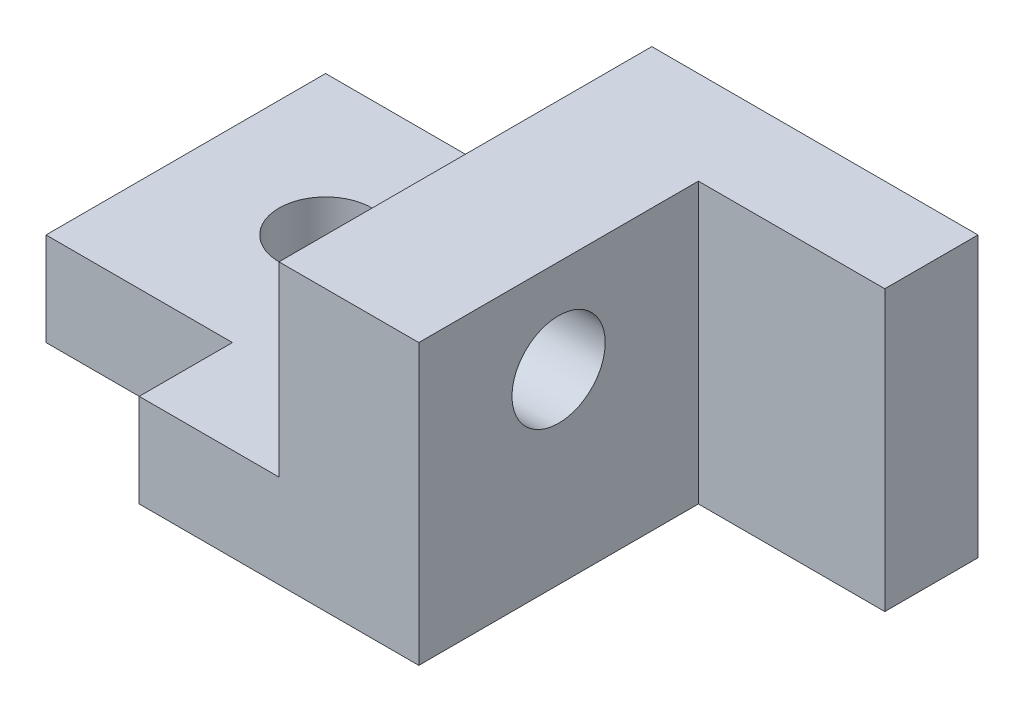
ISO-10303-21;
HEADER;
FILE_DESCRIPTION(('STEP AP214'),'2;1');
FILE_NAME('part.step','',(''),(''),'','','');
FILE_SCHEMA(('AUTOMOTIVE_DESIGN { 1 0 10303 214 1 1 1 1 }'));
ENDSEC;
DATA;
#1=APPLICATION_CONTEXT('core data for automotive mechanical design processes');
#2=APPLICATION_PROTOCOL_DEFINITION('international standard','automotive_design',2000,#1);
#3=PRODUCT_CONTEXT('',#1,'mechanical');
#4=PRODUCT('Part','Part','',(#3));
#5=PRODUCT_RELATED_PRODUCT_CATEGORY('part','',(#4));
#6=PRODUCT_DEFINITION_FORMATION('','',#4);
#7=PRODUCT_DEFINITION_CONTEXT('part definition',#1,'design');
#8=PRODUCT_DEFINITION('design','',#6,#7);
#9=PRODUCT_DEFINITION_SHAPE('','',#8);
#10=(LENGTH_UNIT() NAMED_UNIT(*) SI_UNIT(.MILLI.,.METRE.));
#11=(NAMED_UNIT(*) PLANE_ANGLE_UNIT() SI_UNIT($,.RADIAN.));
#12=(NAMED_UNIT(*) SI_UNIT($,.STERADIAN.) SOLID_ANGLE_UNIT());
#13=UNCERTAINTY_MEASURE_WITH_UNIT(LENGTH_MEASURE(1.E-05),#10,'distance_accuracy_value','');
#14=(GEOMETRIC_REPRESENTATION_CONTEXT(3) GLOBAL_UNCERTAINTY_ASSIGNED_CONTEXT((#13)) GLOBAL_UNIT_ASSIGNED_CONTEXT((#10,
#11,#12)) REPRESENTATION_CONTEXT('',''));
#15=CARTESIAN_POINT('',(0.,0.,0.));
#16=DIRECTION('',(0.,0.,1.));
#17=DIRECTION('',(1.,0.,0.));
#18=AXIS2_PLACEMENT_3D('',#15,#16,#17);
#19=CARTESIAN_POINT('',(0.,30.,0.));
#20=DIRECTION('',(1.,0.,0.));
#21=DIRECTION('',(0.,0.,-1.));
#22=AXIS2_PLACEMENT_3D('',#19,#20,#21);
#23=PLANE('',#22);
#24=DIRECTION('',(0.,0.,1.));
#25=VECTOR('',#24,1.);
#26=CARTESIAN_POINT('',(0.,0.,0.));
#27=LINE('',#26,#25);
#28=CARTESIAN_POINT('',(0.,0.,-40.));
#29=VERTEX_POINT('',#28);
#30=CARTESIAN_POINT('',(0.,0.,-10.));
#31=VERTEX_POINT('',#30);
#32=EDGE_CURVE('E143',#29,#31,#27,.T.);
#33=ORIENTED_EDGE('',*,*,#32,.T.);
#34=DIRECTION('',(0.,1.,0.));
#35=VECTOR('',#34,1.);
#36=CARTESIAN_POINT('',(0.,0.,-10.));
#37=LINE('',#36,#35);
#38=CARTESIAN_POINT('',(0.,10.,-10.));
#39=VERTEX_POINT('',#38);
#40=EDGE_CURVE('E218',#31,#39,#37,.T.);
#41=ORIENTED_EDGE('',*,*,#40,.T.);
#42=DIRECTION('',(0.,0.,1.));
#43=VECTOR('',#42,1.);
#44=CARTESIAN_POINT('',(0.,10.,-40.));
#45=LINE('',#44,#43);
#46=CARTESIAN_POINT('',(0.,10.,-40.));
#47=VERTEX_POINT('',#46);
#48=EDGE_CURVE('E195',#47,#39,#45,.T.);
#49=ORIENTED_EDGE('',*,*,#48,.F.);
#50=DIRECTION('',(0.,-1.,0.));
#51=VECTOR('',#50,1.);
#52=CARTESIAN_POINT('',(0.,30.,-40.));
#53=LINE('',#52,#51);
#54=EDGE_CURVE('E48',#47,#29,#53,.T.);
#55=ORIENTED_EDGE('',*,*,#54,.T.);
#56=EDGE_LOOP('',(#33,#41,#49,#55));
#57=FACE_BOUND('',#56,.T.);
#58=ADVANCED_FACE('F39',(#57),#23,.F.);
#59=CARTESIAN_POINT('',(0.,30.,0.));
#60=DIRECTION('',(0.,0.,-1.));
#61=DIRECTION('',(-1.,0.,0.));
#62=AXIS2_PLACEMENT_3D('',#59,#60,#61);
#63=PLANE('',#62);
#64=DIRECTION('',(-1.,0.,0.));
#65=VECTOR('',#64,1.);
#66=CARTESIAN_POINT('',(35.,10.,0.));
#67=LINE('',#66,#65);
#68=CARTESIAN_POINT('',(35.,10.,0.));
#69=VERTEX_POINT('',#68);
#70=CARTESIAN_POINT('',(20.,10.,0.));
#71=VERTEX_POINT('',#70);
#72=EDGE_CURVE('E134',#69,#71,#67,.T.);
#73=ORIENTED_EDGE('',*,*,#72,.T.);
#74=DIRECTION('',(0.,1.,0.));
#75=VECTOR('',#74,1.);
#76=CARTESIAN_POINT('',(20.,0.,0.));
#77=LINE('',#76,#75);
#78=CARTESIAN_POINT('',(20.,0.,0.));
#79=VERTEX_POINT('',#78);
#80=EDGE_CURVE('E55',#79,#71,#77,.T.);
#81=ORIENTED_EDGE('',*,*,#80,.F.);
#82=DIRECTION('',(1.,0.,0.));
#83=VECTOR('',#82,1.);
#84=CARTESIAN_POINT('',(0.,0.,0.));
#85=LINE('',#84,#83);
#86=CARTESIAN_POINT('',(50.,0.,0.));
#87=VERTEX_POINT('',#86);
#88=EDGE_CURVE('E131',#79,#87,#85,.T.);
#89=ORIENTED_EDGE('',*,*,#88,.T.);
#90=DIRECTION('',(0.,1.,0.));
#91=VECTOR('',#90,1.);
#92=CARTESIAN_POINT('',(50.,0.,0.));
#93=LINE('',#92,#91);
#94=CARTESIAN_POINT('',(50.,30.,0.));
#95=VERTEX_POINT('',#94);
#96=EDGE_CURVE('E180',#87,#95,#93,.T.);
#97=ORIENTED_EDGE('',*,*,#96,.T.);
#98=DIRECTION('',(1.,0.,0.));
#99=VECTOR('',#98,1.);
#100=CARTESIAN_POINT('',(0.,30.,0.));
#101=LINE('',#100,#99);
#102=CARTESIAN_POINT('',(35.,30.,0.));
#103=VERTEX_POINT('',#102);
#104=EDGE_CURVE('E157',#103,#95,#101,.T.);
#105=ORIENTED_EDGE('',*,*,#104,.F.);
#106=DIRECTION('',(0.,-1.,0.));
#107=VECTOR('',#106,1.);
#108=CARTESIAN_POINT('',(35.,30.,0.));
#109=LINE('',#108,#107);
#110=EDGE_CURVE('E63',#103,#69,#109,.T.);
#111=ORIENTED_EDGE('',*,*,#110,.T.);
#112=EDGE_LOOP('',(#73,#81,#89,#97,#105,#111));
#113=FACE_BOUND('',#112,.T.);
#114=ADVANCED_FACE('F129',(#113),#63,.F.);
#115=CARTESIAN_POINT('',(0.,30.,-40.));
#116=DIRECTION('',(0.,0.,1.));
#117=DIRECTION('',(1.,0.,0.));
#118=AXIS2_PLACEMENT_3D('',#115,#116,#117);
#119=PLANE('',#118);
#120=DIRECTION('',(-1.,0.,0.));
#121=VECTOR('',#120,1.);
#122=CARTESIAN_POINT('',(35.,10.,-40.));
#123=LINE('',#122,#121);
#124=CARTESIAN_POINT('',(35.,10.,-40.));
#125=VERTEX_POINT('',#124);
#126=EDGE_CURVE('E208',#125,#47,#123,.T.);
#127=ORIENTED_EDGE('',*,*,#126,.F.);
#128=DIRECTION('',(0.,-1.,0.));
#129=VECTOR('',#128,1.);
#130=CARTESIAN_POINT('',(35.,30.,-40.));
#131=LINE('',#130,#129);
#132=CARTESIAN_POINT('',(35.,30.,-40.));
#133=VERTEX_POINT('',#132);
#134=EDGE_CURVE('E205',#133,#125,#131,.T.);
#135=ORIENTED_EDGE('',*,*,#134,.F.);
#136=DIRECTION('',(-1.,0.,0.));
#137=VECTOR('',#136,1.);
#138=CARTESIAN_POINT('',(0.,30.,-40.));
#139=LINE('',#138,#137);
#140=CARTESIAN_POINT('',(70.,30.,-40.));
#141=VERTEX_POINT('',#140);
#142=EDGE_CURVE('E159',#141,#133,#139,.T.);
#143=ORIENTED_EDGE('',*,*,#142,.F.);
#144=DIRECTION('',(0.,-1.,0.));
#145=VECTOR('',#144,1.);
#146=CARTESIAN_POINT('',(70.,30.,-40.));
#147=LINE('',#146,#145);
#148=CARTESIAN_POINT('',(70.,0.,-40.));
#149=VERTEX_POINT('',#148);
#150=EDGE_CURVE('E11',#141,#149,#147,.T.);
#151=ORIENTED_EDGE('',*,*,#150,.T.);
#152=DIRECTION('',(-1.,0.,0.));
#153=VECTOR('',#152,1.);
#154=CARTESIAN_POINT('',(0.,0.,-40.));
#155=LINE('',#154,#153);
#156=EDGE_CURVE('E147',#149,#29,#155,.T.);
#157=ORIENTED_EDGE('',*,*,#156,.T.);
#158=ORIENTED_EDGE('',*,*,#54,.F.);
#159=EDGE_LOOP('',(#127,#135,#143,#151,#157,#158));
#160=FACE_BOUND('',#159,.T.);
#161=ADVANCED_FACE('F257',(#160),#119,.F.);
#162=CARTESIAN_POINT('',(0.,30.,0.));
#163=DIRECTION('',(0.,-1.,0.));
#164=DIRECTION('',(0.,0.,-1.));
#165=AXIS2_PLACEMENT_3D('',#162,#163,#164);
#166=PLANE('',#165);
#167=DIRECTION('',(0.,0.,1.));
#168=VECTOR('',#167,1.);
#169=CARTESIAN_POINT('',(35.,30.,-40.));
#170=LINE('',#169,#168);
#171=EDGE_CURVE('E199',#133,#103,#170,.T.);
#172=ORIENTED_EDGE('',*,*,#171,.T.);
#173=ORIENTED_EDGE('',*,*,#104,.T.);
#174=DIRECTION('',(0.,0.,-1.));
#175=VECTOR('',#174,1.);
#176=CARTESIAN_POINT('',(50.,30.,0.));
#177=LINE('',#176,#175);
#178=CARTESIAN_POINT('',(50.,30.,-30.));
#179=VERTEX_POINT('',#178);
#180=EDGE_CURVE('E150',#95,#179,#177,.T.);
#181=ORIENTED_EDGE('',*,*,#180,.T.);
#182=DIRECTION('',(1.,0.,0.));
#183=VECTOR('',#182,1.);
#184=CARTESIAN_POINT('',(0.,30.,-30.));
#185=LINE('',#184,#183);
#186=CARTESIAN_POINT('',(70.,30.,-30.));
#187=VERTEX_POINT('',#186);
#188=EDGE_CURVE('E176',#179,#187,#185,.T.);
#189=ORIENTED_EDGE('',*,*,#188,.T.);
#190=DIRECTION('',(0.,0.,-1.));
#191=VECTOR('',#190,1.);
#192=CARTESIAN_POINT('',(70.,30.,0.));
#193=LINE('',#192,#191);
#194=EDGE_CURVE('E165',#187,#141,#193,.T.);
#195=ORIENTED_EDGE('',*,*,#194,.T.);
#196=ORIENTED_EDGE('',*,*,#142,.T.);
#197=EDGE_LOOP('',(#172,#173,#181,#189,#195,#196));
#198=FACE_BOUND('',#197,.T.);
#199=ADVANCED_FACE('F266',(#198),#166,.F.);
#200=CARTESIAN_POINT('',(70.,30.,0.));
#201=DIRECTION('',(-1.,0.,0.));
#202=DIRECTION('',(0.,0.,1.));
#203=AXIS2_PLACEMENT_3D('',#200,#201,#202);
#204=PLANE('',#203);
#205=ORIENTED_EDGE('',*,*,#194,.F.);
#206=DIRECTION('',(0.,1.,0.));
#207=VECTOR('',#206,1.);
#208=CARTESIAN_POINT('',(70.,0.,-30.));
#209=LINE('',#208,#207);
#210=CARTESIAN_POINT('',(70.,0.,-30.));
#211=VERTEX_POINT('',#210);
#212=EDGE_CURVE('E181',#211,#187,#209,.T.);
#213=ORIENTED_EDGE('',*,*,#212,.F.);
#214=DIRECTION('',(0.,0.,-1.));
#215=VECTOR('',#214,1.);
#216=CARTESIAN_POINT('',(70.,0.,0.));
#217=LINE('',#216,#215);
#218=EDGE_CURVE('E142',#211,#149,#217,.T.);
#219=ORIENTED_EDGE('',*,*,#218,.T.);
#220=ORIENTED_EDGE('',*,*,#150,.F.);
#221=EDGE_LOOP('',(#205,#213,#219,#220));
#222=FACE_BOUND('',#221,.T.);
#223=ADVANCED_FACE('F262',(#222),#204,.F.);
#224=CARTESIAN_POINT('',(0.,0.,0.));
#225=DIRECTION('',(0.,-1.,0.));
#226=DIRECTION('',(0.,0.,-1.));
#227=AXIS2_PLACEMENT_3D('',#224,#225,#226);
#228=PLANE('',#227);
#229=CARTESIAN_POINT('',(15.,0.,-25.));
#230=DIRECTION('',(0.,-1.,0.));
#231=DIRECTION('',(0.,0.,-1.));
#232=AXIS2_PLACEMENT_3D('',#229,#230,#231);
#233=CIRCLE('',#232,5.);
#234=CARTESIAN_POINT('',(15.,0.,-30.));
#235=VERTEX_POINT('',#234);
#236=EDGE_CURVE('E230',#235,#235,#233,.T.);
#237=ORIENTED_EDGE('',*,*,#236,.F.);
#238=EDGE_LOOP('',(#237));
#239=FACE_BOUND('',#238,.T.);
#240=DIRECTION('',(-1.,0.,0.));
#241=VECTOR('',#240,1.);
#242=CARTESIAN_POINT('',(0.,0.,-10.));
#243=LINE('',#242,#241);
#244=CARTESIAN_POINT('',(20.,0.,-10.));
#245=VERTEX_POINT('',#244);
#246=EDGE_CURVE('E124',#245,#31,#243,.T.);
#247=ORIENTED_EDGE('',*,*,#246,.T.);
#248=ORIENTED_EDGE('',*,*,#32,.F.);
#249=ORIENTED_EDGE('',*,*,#156,.F.);
#250=ORIENTED_EDGE('',*,*,#218,.F.);
#251=DIRECTION('',(-1.,0.,0.));
#252=VECTOR('',#251,1.);
#253=CARTESIAN_POINT('',(70.,0.,-30.));
#254=LINE('',#253,#252);
#255=CARTESIAN_POINT('',(50.,0.,-30.));
#256=VERTEX_POINT('',#255);
#257=EDGE_CURVE('E192',#211,#256,#254,.T.);
#258=ORIENTED_EDGE('',*,*,#257,.T.);
#259=DIRECTION('',(0.,0.,1.));
#260=VECTOR('',#259,1.);
#261=CARTESIAN_POINT('',(50.,0.,-30.));
#262=LINE('',#261,#260);
#263=EDGE_CURVE('E140',#256,#87,#262,.T.);
#264=ORIENTED_EDGE('',*,*,#263,.T.);
#265=ORIENTED_EDGE('',*,*,#88,.F.);
#266=DIRECTION('',(0.,0.,-1.));
#267=VECTOR('',#266,1.);
#268=CARTESIAN_POINT('',(20.,0.,0.));
#269=LINE('',#268,#267);
#270=EDGE_CURVE('E116',#79,#245,#269,.T.);
#271=ORIENTED_EDGE('',*,*,#270,.T.);
#272=EDGE_LOOP('',(#247,#248,#249,#250,#258,#264,#265,#271));
#273=FACE_BOUND('',#272,.T.);
#274=ADVANCED_FACE('F138',(#239,#273),#228,.T.);
#275=CARTESIAN_POINT('',(50.,0.,-30.));
#276=DIRECTION('',(-1.,0.,0.));
#277=DIRECTION('',(0.,0.,1.));
#278=AXIS2_PLACEMENT_3D('',#275,#276,#277);
#279=PLANE('',#278);
#280=CARTESIAN_POINT('',(50.,20.,-15.));
#281=DIRECTION('',(1.,0.,0.));
#282=DIRECTION('',(0.,0.,-1.));
#283=AXIS2_PLACEMENT_3D('',#280,#281,#282);
#284=CIRCLE('',#283,5.);
#285=CARTESIAN_POINT('',(50.,20.,-20.));
#286=VERTEX_POINT('',#285);
#287=EDGE_CURVE('E215',#286,#286,#284,.T.);
#288=ORIENTED_EDGE('',*,*,#287,.F.);
#289=EDGE_LOOP('',(#288));
#290=FACE_BOUND('',#289,.T.);
#291=ORIENTED_EDGE('',*,*,#96,.F.);
#292=ORIENTED_EDGE('',*,*,#263,.F.);
#293=DIRECTION('',(0.,1.,0.));
#294=VECTOR('',#293,1.);
#295=CARTESIAN_POINT('',(50.,0.,-30.));
#296=LINE('',#295,#294);
#297=EDGE_CURVE('E184',#256,#179,#296,.T.);
#298=ORIENTED_EDGE('',*,*,#297,.T.);
#299=ORIENTED_EDGE('',*,*,#180,.F.);
#300=EDGE_LOOP('',(#291,#292,#298,#299));
#301=FACE_BOUND('',#300,.T.);
#302=ADVANCED_FACE('F270',(#290,#301),#279,.F.);
#303=CARTESIAN_POINT('',(70.,0.,-30.));
#304=DIRECTION('',(0.,0.,-1.));
#305=DIRECTION('',(-1.,0.,0.));
#306=AXIS2_PLACEMENT_3D('',#303,#304,#305);
#307=PLANE('',#306);
#308=ORIENTED_EDGE('',*,*,#297,.F.);
#309=ORIENTED_EDGE('',*,*,#257,.F.);
#310=ORIENTED_EDGE('',*,*,#212,.T.);
#311=ORIENTED_EDGE('',*,*,#188,.F.);
#312=EDGE_LOOP('',(#308,#309,#310,#311));
#313=FACE_BOUND('',#312,.T.);
#314=ADVANCED_FACE('F247',(#313),#307,.F.);
#315=CARTESIAN_POINT('',(35.,10.,-40.));
#316=DIRECTION('',(0.,1.,0.));
#317=DIRECTION('',(-1.,0.,0.));
#318=AXIS2_PLACEMENT_3D('',#315,#316,#317);
#319=PLANE('',#318);
#320=CARTESIAN_POINT('',(15.,10.,-25.));
#321=DIRECTION('',(0.,1.,0.));
#322=DIRECTION('',(-1.,0.,0.));
#323=AXIS2_PLACEMENT_3D('',#320,#321,#322);
#324=CIRCLE('',#323,5.);
#325=CARTESIAN_POINT('',(10.,10.,-25.));
#326=VERTEX_POINT('',#325);
#327=EDGE_CURVE('E236',#326,#326,#324,.T.);
#328=ORIENTED_EDGE('',*,*,#327,.F.);
#329=EDGE_LOOP('',(#328));
#330=FACE_BOUND('',#329,.T.);
#331=DIRECTION('',(-1.,0.,0.));
#332=VECTOR('',#331,1.);
#333=CARTESIAN_POINT('',(0.,10.,-10.));
#334=LINE('',#333,#332);
#335=CARTESIAN_POINT('',(20.,10.,-10.));
#336=VERTEX_POINT('',#335);
#337=EDGE_CURVE('E125',#336,#39,#334,.T.);
#338=ORIENTED_EDGE('',*,*,#337,.F.);
#339=DIRECTION('',(0.,0.,-1.));
#340=VECTOR('',#339,1.);
#341=CARTESIAN_POINT('',(20.,10.,0.));
#342=LINE('',#341,#340);
#343=EDGE_CURVE('E227',#71,#336,#342,.T.);
#344=ORIENTED_EDGE('',*,*,#343,.F.);
#345=ORIENTED_EDGE('',*,*,#72,.F.);
#346=DIRECTION('',(0.,0.,1.));
#347=VECTOR('',#346,1.);
#348=CARTESIAN_POINT('',(35.,10.,-40.));
#349=LINE('',#348,#347);
#350=EDGE_CURVE('E202',#125,#69,#349,.T.);
#351=ORIENTED_EDGE('',*,*,#350,.F.);
#352=ORIENTED_EDGE('',*,*,#126,.T.);
#353=ORIENTED_EDGE('',*,*,#48,.T.);
#354=EDGE_LOOP('',(#338,#344,#345,#351,#352,#353));
#355=FACE_BOUND('',#354,.T.);
#356=ADVANCED_FACE('F243',(#330,#355),#319,.T.);
#357=CARTESIAN_POINT('',(35.,30.,-40.));
#358=DIRECTION('',(-1.,0.,0.));
#359=DIRECTION('',(0.,0.,1.));
#360=AXIS2_PLACEMENT_3D('',#357,#358,#359);
#361=PLANE('',#360);
#362=CARTESIAN_POINT('',(35.,20.,-15.));
#363=DIRECTION('',(-1.,0.,0.));
#364=DIRECTION('',(0.,0.,1.));
#365=AXIS2_PLACEMENT_3D('',#362,#363,#364);
#366=CIRCLE('',#365,5.);
#367=CARTESIAN_POINT('',(35.,20.,-10.));
#368=VERTEX_POINT('',#367);
#369=EDGE_CURVE('E42',#368,#368,#366,.T.);
#370=ORIENTED_EDGE('',*,*,#369,.F.);
#371=EDGE_LOOP('',(#370));
#372=FACE_BOUND('',#371,.T.);
#373=ORIENTED_EDGE('',*,*,#110,.F.);
#374=ORIENTED_EDGE('',*,*,#171,.F.);
#375=ORIENTED_EDGE('',*,*,#134,.T.);
#376=ORIENTED_EDGE('',*,*,#350,.T.);
#377=EDGE_LOOP('',(#373,#374,#375,#376));
#378=FACE_BOUND('',#377,.T.);
#379=ADVANCED_FACE('F246',(#372,#378),#361,.T.);
#380=CARTESIAN_POINT('',(20.,20.,-15.));
#381=DIRECTION('',(1.,0.,0.));
#382=DIRECTION('',(0.,0.,-1.));
#383=AXIS2_PLACEMENT_3D('',#380,#381,#382);
#384=CYLINDRICAL_SURFACE('',#383,5.);
#385=ORIENTED_EDGE('',*,*,#369,.T.);
#386=EDGE_LOOP('',(#385));
#387=FACE_BOUND('',#386,.T.);
#388=ORIENTED_EDGE('',*,*,#287,.T.);
#389=EDGE_LOOP('',(#388));
#390=FACE_BOUND('',#389,.T.);
#391=ADVANCED_FACE('F340',(#387,#390),#384,.F.);
#392=CARTESIAN_POINT('',(0.,0.,-10.));
#393=DIRECTION('',(0.,0.,-1.));
#394=DIRECTION('',(-1.,0.,0.));
#395=AXIS2_PLACEMENT_3D('',#392,#393,#394);
#396=PLANE('',#395);
#397=ORIENTED_EDGE('',*,*,#337,.T.);
#398=ORIENTED_EDGE('',*,*,#40,.F.);
#399=ORIENTED_EDGE('',*,*,#246,.F.);
#400=DIRECTION('',(0.,1.,0.));
#401=VECTOR('',#400,1.);
#402=CARTESIAN_POINT('',(20.,0.,-10.));
#403=LINE('',#402,#401);
#404=EDGE_CURVE('E118',#245,#336,#403,.T.);
#405=ORIENTED_EDGE('',*,*,#404,.T.);
#406=EDGE_LOOP('',(#397,#398,#399,#405));
#407=FACE_BOUND('',#406,.T.);
#408=ADVANCED_FACE('F251',(#407),#396,.F.);
#409=CARTESIAN_POINT('',(20.,0.,0.));
#410=DIRECTION('',(1.,0.,0.));
#411=DIRECTION('',(0.,1.,0.));
#412=AXIS2_PLACEMENT_3D('',#409,#410,#411);
#413=PLANE('',#412);
#414=ORIENTED_EDGE('',*,*,#343,.T.);
#415=ORIENTED_EDGE('',*,*,#404,.F.);
#416=ORIENTED_EDGE('',*,*,#270,.F.);
#417=ORIENTED_EDGE('',*,*,#80,.T.);
#418=EDGE_LOOP('',(#414,#415,#416,#417));
#419=FACE_BOUND('',#418,.T.);
#420=ADVANCED_FACE('F117',(#419),#413,.F.);
#421=CARTESIAN_POINT('',(15.,-20.,-25.));
#422=DIRECTION('',(0.,1.,0.));
#423=DIRECTION('',(-1.,0.,0.));
#424=AXIS2_PLACEMENT_3D('',#421,#422,#423);
#425=CYLINDRICAL_SURFACE('',#424,5.);
#426=ORIENTED_EDGE('',*,*,#236,.T.);
#427=EDGE_LOOP('',(#426));
#428=FACE_BOUND('',#427,.T.);
#429=ORIENTED_EDGE('',*,*,#327,.T.);
#430=EDGE_LOOP('',(#429));
#431=FACE_BOUND('',#430,.T.);
#432=ADVANCED_FACE('F241',(#428,#431),#425,.F.);
#433=CLOSED_SHELL('',(#58,#114,#161,#199,#223,#274,#302,#314,#356,#379,#391,#408,#420,#432));
#434=MANIFOLD_SOLID_BREP('B2',#433);
#435=ADVANCED_BREP_SHAPE_REPRESENTATION('',(#18,#434),#14);
#436=SHAPE_DEFINITION_REPRESENTATION(#9,#435);
ENDSEC;
END-ISO-10303-21;
